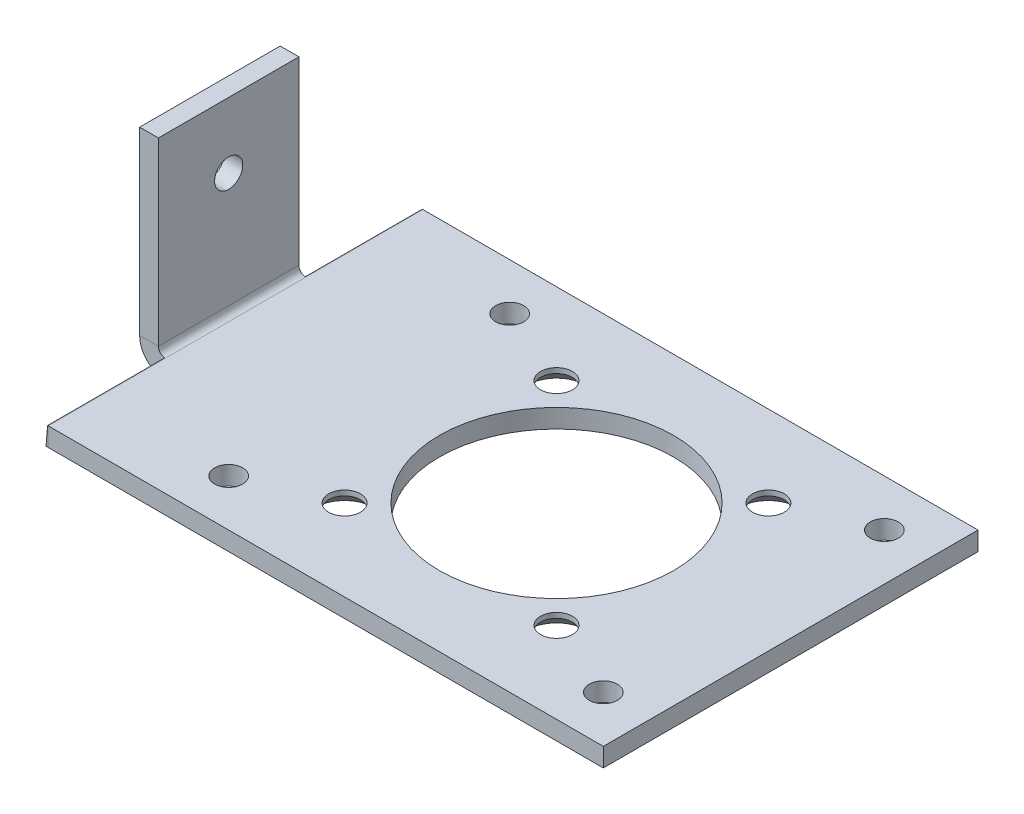
ISO-10303-21;
HEADER;
FILE_DESCRIPTION(('STEP AP214'),'2;1');
FILE_NAME('part.step','',(''),(''),'','','');
FILE_SCHEMA(('AUTOMOTIVE_DESIGN { 1 0 10303 214 1 1 1 1 }'));
ENDSEC;
DATA;
#1=APPLICATION_CONTEXT('core data for automotive mechanical design processes');
#2=APPLICATION_PROTOCOL_DEFINITION('international standard','automotive_design',2000,#1);
#3=PRODUCT_CONTEXT('',#1,'mechanical');
#4=PRODUCT('Part','Part','',(#3));
#5=PRODUCT_RELATED_PRODUCT_CATEGORY('part','',(#4));
#6=PRODUCT_DEFINITION_FORMATION('','',#4);
#7=PRODUCT_DEFINITION_CONTEXT('part definition',#1,'design');
#8=PRODUCT_DEFINITION('design','',#6,#7);
#9=PRODUCT_DEFINITION_SHAPE('','',#8);
#10=(LENGTH_UNIT() NAMED_UNIT(*) SI_UNIT(.MILLI.,.METRE.));
#11=(NAMED_UNIT(*) PLANE_ANGLE_UNIT() SI_UNIT($,.RADIAN.));
#12=(NAMED_UNIT(*) SI_UNIT($,.STERADIAN.) SOLID_ANGLE_UNIT());
#13=UNCERTAINTY_MEASURE_WITH_UNIT(LENGTH_MEASURE(1.E-05),#10,'distance_accuracy_value','');
#14=(GEOMETRIC_REPRESENTATION_CONTEXT(3) GLOBAL_UNCERTAINTY_ASSIGNED_CONTEXT((#13)) GLOBAL_UNIT_ASSIGNED_CONTEXT((#10,
#11,#12)) REPRESENTATION_CONTEXT('',''));
#15=CARTESIAN_POINT('',(0.,0.,0.));
#16=DIRECTION('',(0.,0.,1.));
#17=DIRECTION('',(1.,0.,0.));
#18=AXIS2_PLACEMENT_3D('',#15,#16,#17);
#19=CARTESIAN_POINT('',(0.7366,0.7366,40.));
#20=DIRECTION('',(0.,0.,-1.));
#21=DIRECTION('',(-1.,0.,0.));
#22=AXIS2_PLACEMENT_3D('',#19,#20,#21);
#23=CYLINDRICAL_SURFACE('',#22,0.7366);
#24=DIRECTION('',(0.,0.,-1.));
#25=VECTOR('',#24,1.);
#26=CARTESIAN_POINT('',(0.672915296353139,0.0027581788141183,40.));
#27=LINE('',#26,#25);
#28=CARTESIAN_POINT('',(0.672915296353139,0.0027581788141183,0.));
#29=VERTEX_POINT('',#28);
#30=CARTESIAN_POINT('',(0.672915296353139,0.0027581788141183,12.5));
#31=VERTEX_POINT('',#30);
#32=EDGE_CURVE('E65',#29,#31,#27,.F.);
#33=ORIENTED_EDGE('',*,*,#32,.T.);
#34=CARTESIAN_POINT('',(0.7366,0.7366,12.5));
#35=DIRECTION('',(0.,0.,1.));
#36=DIRECTION('',(0.,-1.,0.));
#37=AXIS2_PLACEMENT_3D('',#34,#35,#36);
#38=CIRCLE('',#37,0.7366);
#39=CARTESIAN_POINT('',(0.,0.7366,12.5));
#40=VERTEX_POINT('',#39);
#41=EDGE_CURVE('E141',#40,#31,#38,.T.);
#42=ORIENTED_EDGE('',*,*,#41,.F.);
#43=DIRECTION('',(0.,0.,-1.));
#44=VECTOR('',#43,1.);
#45=CARTESIAN_POINT('',(0.,0.7366,40.));
#46=LINE('',#45,#44);
#47=CARTESIAN_POINT('',(0.,0.7366,27.5));
#48=VERTEX_POINT('',#47);
#49=EDGE_CURVE('E293',#48,#40,#46,.T.);
#50=ORIENTED_EDGE('',*,*,#49,.F.);
#51=CARTESIAN_POINT('',(0.7366,0.7366,27.5));
#52=DIRECTION('',(0.,0.,-1.));
#53=DIRECTION('',(0.,1.,0.));
#54=AXIS2_PLACEMENT_3D('',#51,#52,#53);
#55=CIRCLE('',#54,0.7366);
#56=CARTESIAN_POINT('',(0.672915296353139,0.0027581788141183,27.5));
#57=VERTEX_POINT('',#56);
#58=EDGE_CURVE('E181',#57,#48,#55,.T.);
#59=ORIENTED_EDGE('',*,*,#58,.F.);
#60=DIRECTION('',(0.,0.,-1.));
#61=VECTOR('',#60,1.);
#62=CARTESIAN_POINT('',(0.672915296353139,0.0027581788141183,40.));
#63=LINE('',#62,#61);
#64=CARTESIAN_POINT('',(0.672915296353139,0.0027581788141183,40.));
#65=VERTEX_POINT('',#64);
#66=EDGE_CURVE('E175',#65,#57,#63,.T.);
#67=ORIENTED_EDGE('',*,*,#66,.F.);
#68=CARTESIAN_POINT('',(0.7366,0.7366,40.));
#69=DIRECTION('',(0.,0.,-1.));
#70=DIRECTION('',(-1.,0.,0.));
#71=AXIS2_PLACEMENT_3D('',#68,#69,#70);
#72=CIRCLE('',#71,0.7366);
#73=CARTESIAN_POINT('',(0.7366,0.,40.));
#74=VERTEX_POINT('',#73);
#75=EDGE_CURVE('E267',#65,#74,#72,.F.);
#76=ORIENTED_EDGE('',*,*,#75,.T.);
#77=DIRECTION('',(0.,0.,-1.));
#78=VECTOR('',#77,1.);
#79=CARTESIAN_POINT('',(0.7366,0.,40.));
#80=LINE('',#79,#78);
#81=CARTESIAN_POINT('',(0.7366,0.,0.));
#82=VERTEX_POINT('',#81);
#83=EDGE_CURVE('E295',#74,#82,#80,.T.);
#84=ORIENTED_EDGE('',*,*,#83,.T.);
#85=CARTESIAN_POINT('',(0.7366,0.7366,0.));
#86=DIRECTION('',(0.,0.,-1.));
#87=DIRECTION('',(-1.,0.,0.));
#88=AXIS2_PLACEMENT_3D('',#85,#86,#87);
#89=CIRCLE('',#88,0.7366);
#90=EDGE_CURVE('E159',#29,#82,#89,.F.);
#91=ORIENTED_EDGE('',*,*,#90,.F.);
#92=EDGE_LOOP('',(#33,#42,#50,#59,#67,#76,#84,#91));
#93=FACE_BOUND('',#92,.T.);
#94=ADVANCED_FACE('F48',(#93),#23,.F.);
#95=CARTESIAN_POINT('',(0.,0.,40.));
#96=DIRECTION('',(1.,0.,0.));
#97=DIRECTION('',(0.,0.,-1.));
#98=AXIS2_PLACEMENT_3D('',#95,#96,#97);
#99=PLANE('',#98);
#100=CARTESIAN_POINT('',(0.,13.,20.));
#101=DIRECTION('',(1.,0.,0.));
#102=DIRECTION('',(0.,0.,-1.));
#103=AXIS2_PLACEMENT_3D('',#100,#101,#102);
#104=CIRCLE('',#103,1.49999999999999);
#105=CARTESIAN_POINT('',(0.,13.,18.5));
#106=VERTEX_POINT('',#105);
#107=EDGE_CURVE('E248',#106,#106,#104,.T.);
#108=ORIENTED_EDGE('',*,*,#107,.F.);
#109=EDGE_LOOP('',(#108));
#110=FACE_BOUND('',#109,.T.);
#111=ORIENTED_EDGE('',*,*,#49,.T.);
#112=DIRECTION('',(0.,-1.,0.));
#113=VECTOR('',#112,1.);
#114=CARTESIAN_POINT('',(0.,0.,12.5));
#115=LINE('',#114,#113);
#116=CARTESIAN_POINT('',(0.,20.,12.5));
#117=VERTEX_POINT('',#116);
#118=EDGE_CURVE('E164',#117,#40,#115,.T.);
#119=ORIENTED_EDGE('',*,*,#118,.F.);
#120=DIRECTION('',(0.,0.,-1.));
#121=VECTOR('',#120,1.);
#122=CARTESIAN_POINT('',(0.,20.,40.));
#123=LINE('',#122,#121);
#124=CARTESIAN_POINT('',(0.,20.,27.5));
#125=VERTEX_POINT('',#124);
#126=EDGE_CURVE('E290',#125,#117,#123,.T.);
#127=ORIENTED_EDGE('',*,*,#126,.F.);
#128=DIRECTION('',(0.,1.,0.));
#129=VECTOR('',#128,1.);
#130=CARTESIAN_POINT('',(0.,0.,27.5));
#131=LINE('',#130,#129);
#132=EDGE_CURVE('E188',#125,#48,#131,.F.);
#133=ORIENTED_EDGE('',*,*,#132,.T.);
#134=EDGE_LOOP('',(#111,#119,#127,#133));
#135=FACE_BOUND('',#134,.T.);
#136=ADVANCED_FACE('F372',(#110,#135),#99,.T.);
#137=CARTESIAN_POINT('',(-2.,20.,40.));
#138=DIRECTION('',(0.,1.,0.));
#139=DIRECTION('',(0.,0.,1.));
#140=AXIS2_PLACEMENT_3D('',#137,#138,#139);
#141=PLANE('',#140);
#142=ORIENTED_EDGE('',*,*,#126,.T.);
#143=DIRECTION('',(1.,0.,0.));
#144=VECTOR('',#143,1.);
#145=CARTESIAN_POINT('',(0.,20.,12.5));
#146=LINE('',#145,#144);
#147=CARTESIAN_POINT('',(-2.,20.,12.5));
#148=VERTEX_POINT('',#147);
#149=EDGE_CURVE('E169',#117,#148,#146,.F.);
#150=ORIENTED_EDGE('',*,*,#149,.T.);
#151=DIRECTION('',(0.,0.,-1.));
#152=VECTOR('',#151,1.);
#153=CARTESIAN_POINT('',(-2.,20.,40.));
#154=LINE('',#153,#152);
#155=CARTESIAN_POINT('',(-2.,20.,27.5));
#156=VERTEX_POINT('',#155);
#157=EDGE_CURVE('E287',#156,#148,#154,.T.);
#158=ORIENTED_EDGE('',*,*,#157,.F.);
#159=DIRECTION('',(-1.,0.,0.));
#160=VECTOR('',#159,1.);
#161=CARTESIAN_POINT('',(-2.,20.,27.5));
#162=LINE('',#161,#160);
#163=EDGE_CURVE('E193',#156,#125,#162,.F.);
#164=ORIENTED_EDGE('',*,*,#163,.T.);
#165=EDGE_LOOP('',(#142,#150,#158,#164));
#166=FACE_BOUND('',#165,.T.);
#167=ADVANCED_FACE('F377',(#166),#141,.T.);
#168=CARTESIAN_POINT('',(-2.,0.,40.));
#169=DIRECTION('',(1.,0.,0.));
#170=DIRECTION('',(0.,0.,-1.));
#171=AXIS2_PLACEMENT_3D('',#168,#169,#170);
#172=PLANE('',#171);
#173=CARTESIAN_POINT('',(-2.,13.,20.));
#174=DIRECTION('',(-1.,0.,0.));
#175=DIRECTION('',(0.,0.,1.));
#176=AXIS2_PLACEMENT_3D('',#173,#174,#175);
#177=CIRCLE('',#176,1.5);
#178=CARTESIAN_POINT('',(-2.,13.,21.5));
#179=VERTEX_POINT('',#178);
#180=EDGE_CURVE('E245',#179,#179,#177,.T.);
#181=ORIENTED_EDGE('',*,*,#180,.F.);
#182=EDGE_LOOP('',(#181));
#183=FACE_BOUND('',#182,.T.);
#184=DIRECTION('',(0.,1.,0.));
#185=VECTOR('',#184,1.);
#186=CARTESIAN_POINT('',(-2.,0.,12.5));
#187=LINE('',#186,#185);
#188=CARTESIAN_POINT('',(-2.,0.7366,12.5));
#189=VERTEX_POINT('',#188);
#190=EDGE_CURVE('E166',#148,#189,#187,.F.);
#191=ORIENTED_EDGE('',*,*,#190,.T.);
#192=DIRECTION('',(0.,0.,-1.));
#193=VECTOR('',#192,1.);
#194=CARTESIAN_POINT('',(-2.,0.7366,40.));
#195=LINE('',#194,#193);
#196=CARTESIAN_POINT('',(-2.,0.7366,27.5));
#197=VERTEX_POINT('',#196);
#198=EDGE_CURVE('E284',#197,#189,#195,.T.);
#199=ORIENTED_EDGE('',*,*,#198,.F.);
#200=DIRECTION('',(0.,-1.,0.));
#201=VECTOR('',#200,1.);
#202=CARTESIAN_POINT('',(-2.,20.,27.5));
#203=LINE('',#202,#201);
#204=EDGE_CURVE('E186',#156,#197,#203,.T.);
#205=ORIENTED_EDGE('',*,*,#204,.F.);
#206=ORIENTED_EDGE('',*,*,#157,.T.);
#207=EDGE_LOOP('',(#191,#199,#205,#206));
#208=FACE_BOUND('',#207,.T.);
#209=ADVANCED_FACE('F383',(#183,#208),#172,.F.);
#210=CARTESIAN_POINT('',(0.7366,0.7366,40.));
#211=DIRECTION('',(0.,0.,-1.));
#212=DIRECTION('',(-1.,0.,0.));
#213=AXIS2_PLACEMENT_3D('',#210,#211,#212);
#214=CYLINDRICAL_SURFACE('',#213,2.7366);
#215=CARTESIAN_POINT('',(0.7366,0.7366,12.5));
#216=DIRECTION('',(0.,0.,-1.));
#217=DIRECTION('',(-1.,0.,0.));
#218=AXIS2_PLACEMENT_3D('',#215,#216,#217);
#219=CIRCLE('',#218,2.7366);
#220=CARTESIAN_POINT('',(0.5,-1.98975287517959,12.5));
#221=VERTEX_POINT('',#220);
#222=EDGE_CURVE('E150',#189,#221,#219,.F.);
#223=ORIENTED_EDGE('',*,*,#222,.T.);
#224=DIRECTION('',(0.,0.,-1.));
#225=VECTOR('',#224,1.);
#226=CARTESIAN_POINT('',(0.5,-1.98975287517959,40.));
#227=LINE('',#226,#225);
#228=CARTESIAN_POINT('',(0.5,-1.98975287517959,0.));
#229=VERTEX_POINT('',#228);
#230=EDGE_CURVE('E155',#229,#221,#227,.F.);
#231=ORIENTED_EDGE('',*,*,#230,.F.);
#232=CARTESIAN_POINT('',(0.7366,0.7366,0.));
#233=DIRECTION('',(0.,0.,1.));
#234=DIRECTION('',(1.,0.,0.));
#235=AXIS2_PLACEMENT_3D('',#232,#233,#234);
#236=CIRCLE('',#235,2.7366);
#237=CARTESIAN_POINT('',(0.7366,-2.,0.));
#238=VERTEX_POINT('',#237);
#239=EDGE_CURVE('E261',#229,#238,#236,.T.);
#240=ORIENTED_EDGE('',*,*,#239,.T.);
#241=DIRECTION('',(0.,0.,-1.));
#242=VECTOR('',#241,1.);
#243=CARTESIAN_POINT('',(0.7366,-2.,40.));
#244=LINE('',#243,#242);
#245=CARTESIAN_POINT('',(0.7366,-2.,40.));
#246=VERTEX_POINT('',#245);
#247=EDGE_CURVE('E271',#246,#238,#244,.T.);
#248=ORIENTED_EDGE('',*,*,#247,.F.);
#249=CARTESIAN_POINT('',(0.7366,0.7366,40.));
#250=DIRECTION('',(0.,0.,1.));
#251=DIRECTION('',(1.,0.,0.));
#252=AXIS2_PLACEMENT_3D('',#249,#250,#251);
#253=CIRCLE('',#252,2.7366);
#254=CARTESIAN_POINT('',(0.5,-1.98975287517959,40.));
#255=VERTEX_POINT('',#254);
#256=EDGE_CURVE('E269',#255,#246,#253,.T.);
#257=ORIENTED_EDGE('',*,*,#256,.F.);
#258=DIRECTION('',(0.,0.,-1.));
#259=VECTOR('',#258,1.);
#260=CARTESIAN_POINT('',(0.5,-1.98975287517959,40.));
#261=LINE('',#260,#259);
#262=CARTESIAN_POINT('',(0.5,-1.98975287517959,27.5));
#263=VERTEX_POINT('',#262);
#264=EDGE_CURVE('E172',#255,#263,#261,.T.);
#265=ORIENTED_EDGE('',*,*,#264,.T.);
#266=CARTESIAN_POINT('',(0.7366,0.7366,27.5));
#267=DIRECTION('',(0.,0.,-1.));
#268=DIRECTION('',(-1.,0.,0.));
#269=AXIS2_PLACEMENT_3D('',#266,#267,#268);
#270=CIRCLE('',#269,2.7366);
#271=EDGE_CURVE('E183',#263,#197,#270,.T.);
#272=ORIENTED_EDGE('',*,*,#271,.T.);
#273=ORIENTED_EDGE('',*,*,#198,.T.);
#274=EDGE_LOOP('',(#223,#231,#240,#248,#257,#265,#272,#273));
#275=FACE_BOUND('',#274,.T.);
#276=ADVANCED_FACE('F360',(#275),#214,.T.);
#277=CARTESIAN_POINT('',(0.,0.7366,0.));
#278=DIRECTION('',(0.,0.,-1.));
#279=DIRECTION('',(-1.,0.,0.));
#280=AXIS2_PLACEMENT_3D('',#277,#278,#279);
#281=PLANE('',#280);
#282=ORIENTED_EDGE('',*,*,#239,.F.);
#283=DIRECTION('',(-0.0864576481765695,-0.996255526996852,0.));
#284=VECTOR('',#283,1.);
#285=CARTESIAN_POINT('',(0.5,-1.98975287517959,0.));
#286=LINE('',#285,#284);
#287=EDGE_CURVE('E151',#229,#29,#286,.F.);
#288=ORIENTED_EDGE('',*,*,#287,.T.);
#289=ORIENTED_EDGE('',*,*,#90,.T.);
#290=DIRECTION('',(0.,1.,0.));
#291=VECTOR('',#290,1.);
#292=CARTESIAN_POINT('',(0.7366,-2.,0.));
#293=LINE('',#292,#291);
#294=EDGE_CURVE('E57',#238,#82,#293,.T.);
#295=ORIENTED_EDGE('',*,*,#294,.F.);
#296=EDGE_LOOP('',(#282,#288,#289,#295));
#297=FACE_BOUND('',#296,.T.);
#298=ADVANCED_FACE('F390',(#297),#281,.T.);
#299=CARTESIAN_POINT('',(0.7366,0.,40.));
#300=DIRECTION('',(0.,0.,1.));
#301=DIRECTION('',(1.,0.,0.));
#302=AXIS2_PLACEMENT_3D('',#299,#300,#301);
#303=PLANE('',#302);
#304=ORIENTED_EDGE('',*,*,#75,.F.);
#305=DIRECTION('',(-0.0864576481765695,-0.996255526996852,0.));
#306=VECTOR('',#305,1.);
#307=CARTESIAN_POINT('',(0.5,-1.98975287517959,40.));
#308=LINE('',#307,#306);
#309=EDGE_CURVE('E179',#255,#65,#308,.F.);
#310=ORIENTED_EDGE('',*,*,#309,.F.);
#311=ORIENTED_EDGE('',*,*,#256,.T.);
#312=DIRECTION('',(0.,-1.,0.));
#313=VECTOR('',#312,1.);
#314=CARTESIAN_POINT('',(0.7366,0.,40.));
#315=LINE('',#314,#313);
#316=EDGE_CURVE('E13',#74,#246,#315,.T.);
#317=ORIENTED_EDGE('',*,*,#316,.F.);
#318=EDGE_LOOP('',(#304,#310,#311,#317));
#319=FACE_BOUND('',#318,.T.);
#320=ADVANCED_FACE('F50',(#319),#303,.T.);
#321=CARTESIAN_POINT('',(-2.,0.7366,40.));
#322=DIRECTION('',(0.,0.,1.));
#323=DIRECTION('',(1.,0.,0.));
#324=AXIS2_PLACEMENT_3D('',#321,#322,#323);
#325=PLANE('',#324);
#326=DIRECTION('',(1.,0.,0.));
#327=VECTOR('',#326,1.);
#328=CARTESIAN_POINT('',(0.,0.,40.));
#329=LINE('',#328,#327);
#330=CARTESIAN_POINT('',(60.,0.,40.));
#331=VERTEX_POINT('',#330);
#332=EDGE_CURVE('E264',#74,#331,#329,.T.);
#333=ORIENTED_EDGE('',*,*,#332,.F.);
#334=ORIENTED_EDGE('',*,*,#316,.T.);
#335=DIRECTION('',(1.,0.,0.));
#336=VECTOR('',#335,1.);
#337=CARTESIAN_POINT('',(0.,-2.,40.));
#338=LINE('',#337,#336);
#339=CARTESIAN_POINT('',(60.,-2.,40.));
#340=VERTEX_POINT('',#339);
#341=EDGE_CURVE('E258',#246,#340,#338,.T.);
#342=ORIENTED_EDGE('',*,*,#341,.T.);
#343=DIRECTION('',(0.,-1.,0.));
#344=VECTOR('',#343,1.);
#345=CARTESIAN_POINT('',(60.,0.,40.));
#346=LINE('',#345,#344);
#347=EDGE_CURVE('E260',#331,#340,#346,.T.);
#348=ORIENTED_EDGE('',*,*,#347,.F.);
#349=EDGE_LOOP('',(#333,#334,#342,#348));
#350=FACE_BOUND('',#349,.T.);
#351=ADVANCED_FACE('F355',(#350),#325,.T.);
#352=CARTESIAN_POINT('',(0.,-2.,40.));
#353=DIRECTION('',(0.,1.,0.));
#354=DIRECTION('',(0.,0.,1.));
#355=AXIS2_PLACEMENT_3D('',#352,#353,#354);
#356=PLANE('',#355);
#357=CARTESIAN_POINT('',(46.3137084989847,-2.,8.68629150101517));
#358=DIRECTION('',(0.,-1.,0.));
#359=DIRECTION('',(0.,0.,-1.));
#360=AXIS2_PLACEMENT_3D('',#357,#358,#359);
#361=CIRCLE('',#360,3.15);
#362=CARTESIAN_POINT('',(46.3137084989847,-2.,5.53629150101517));
#363=VERTEX_POINT('',#362);
#364=EDGE_CURVE('E196',#363,#363,#361,.T.);
#365=ORIENTED_EDGE('',*,*,#364,.F.);
#366=EDGE_LOOP('',(#365));
#367=FACE_BOUND('',#366,.T.);
#368=CARTESIAN_POINT('',(46.3137084989847,-2.,31.3137084989848));
#369=DIRECTION('',(0.,-1.,0.));
#370=DIRECTION('',(0.,0.,-1.));
#371=AXIS2_PLACEMENT_3D('',#368,#369,#370);
#372=CIRCLE('',#371,3.15);
#373=CARTESIAN_POINT('',(46.3137084989847,-2.,28.1637084989848));
#374=VERTEX_POINT('',#373);
#375=EDGE_CURVE('E204',#374,#374,#372,.T.);
#376=ORIENTED_EDGE('',*,*,#375,.F.);
#377=EDGE_LOOP('',(#376));
#378=FACE_BOUND('',#377,.T.);
#379=CARTESIAN_POINT('',(23.6862915010153,-2.,31.3137084989848));
#380=DIRECTION('',(0.,-1.,0.));
#381=DIRECTION('',(0.,0.,-1.));
#382=AXIS2_PLACEMENT_3D('',#379,#380,#381);
#383=CIRCLE('',#382,3.15);
#384=CARTESIAN_POINT('',(23.6862915010153,-2.,28.1637084989848));
#385=VERTEX_POINT('',#384);
#386=EDGE_CURVE('E211',#385,#385,#383,.T.);
#387=ORIENTED_EDGE('',*,*,#386,.F.);
#388=EDGE_LOOP('',(#387));
#389=FACE_BOUND('',#388,.T.);
#390=CARTESIAN_POINT('',(23.6862915010153,-2.,8.68629150101518));
#391=DIRECTION('',(0.,-1.,0.));
#392=DIRECTION('',(0.,0.,-1.));
#393=AXIS2_PLACEMENT_3D('',#390,#391,#392);
#394=CIRCLE('',#393,3.15);
#395=CARTESIAN_POINT('',(23.6862915010153,-2.,5.53629150101518));
#396=VERTEX_POINT('',#395);
#397=EDGE_CURVE('E218',#396,#396,#394,.T.);
#398=ORIENTED_EDGE('',*,*,#397,.F.);
#399=EDGE_LOOP('',(#398));
#400=FACE_BOUND('',#399,.T.);
#401=CARTESIAN_POINT('',(15.,-2.,5.));
#402=DIRECTION('',(0.,-1.,0.));
#403=DIRECTION('',(0.,0.,-1.));
#404=AXIS2_PLACEMENT_3D('',#401,#402,#403);
#405=CIRCLE('',#404,1.49999999999999);
#406=CARTESIAN_POINT('',(15.,-2.,3.50000000000001));
#407=VERTEX_POINT('',#406);
#408=EDGE_CURVE('E225',#407,#407,#405,.T.);
#409=ORIENTED_EDGE('',*,*,#408,.F.);
#410=EDGE_LOOP('',(#409));
#411=FACE_BOUND('',#410,.T.);
#412=CARTESIAN_POINT('',(55.,-2.,5.));
#413=DIRECTION('',(0.,-1.,0.));
#414=DIRECTION('',(0.,0.,-1.));
#415=AXIS2_PLACEMENT_3D('',#412,#413,#414);
#416=CIRCLE('',#415,1.49999999999999);
#417=CARTESIAN_POINT('',(55.,-2.,3.50000000000001));
#418=VERTEX_POINT('',#417);
#419=EDGE_CURVE('E231',#418,#418,#416,.T.);
#420=ORIENTED_EDGE('',*,*,#419,.F.);
#421=EDGE_LOOP('',(#420));
#422=FACE_BOUND('',#421,.T.);
#423=CARTESIAN_POINT('',(55.,-2.,34.9999999999996));
#424=DIRECTION('',(0.,-1.,0.));
#425=DIRECTION('',(0.,0.,-1.));
#426=AXIS2_PLACEMENT_3D('',#423,#424,#425);
#427=CIRCLE('',#426,1.49999999999999);
#428=CARTESIAN_POINT('',(55.,-2.,33.4999999999996));
#429=VERTEX_POINT('',#428);
#430=EDGE_CURVE('E235',#429,#429,#427,.T.);
#431=ORIENTED_EDGE('',*,*,#430,.F.);
#432=EDGE_LOOP('',(#431));
#433=FACE_BOUND('',#432,.T.);
#434=CARTESIAN_POINT('',(15.,-2.,35.));
#435=DIRECTION('',(0.,-1.,0.));
#436=DIRECTION('',(0.,0.,-1.));
#437=AXIS2_PLACEMENT_3D('',#434,#435,#436);
#438=CIRCLE('',#437,1.49999999999999);
#439=CARTESIAN_POINT('',(15.,-2.,33.5));
#440=VERTEX_POINT('',#439);
#441=EDGE_CURVE('E239',#440,#440,#438,.T.);
#442=ORIENTED_EDGE('',*,*,#441,.F.);
#443=EDGE_LOOP('',(#442));
#444=FACE_BOUND('',#443,.T.);
#445=CARTESIAN_POINT('',(35.,-2.,20.));
#446=DIRECTION('',(0.,-1.,0.));
#447=DIRECTION('',(0.,0.,-1.));
#448=AXIS2_PLACEMENT_3D('',#445,#446,#447);
#449=CIRCLE('',#448,12.5);
#450=CARTESIAN_POINT('',(35.,-2.,7.5));
#451=VERTEX_POINT('',#450);
#452=EDGE_CURVE('E252',#451,#451,#449,.T.);
#453=ORIENTED_EDGE('',*,*,#452,.F.);
#454=EDGE_LOOP('',(#453));
#455=FACE_BOUND('',#454,.T.);
#456=DIRECTION('',(1.,0.,0.));
#457=VECTOR('',#456,1.);
#458=CARTESIAN_POINT('',(0.,-2.,0.));
#459=LINE('',#458,#457);
#460=CARTESIAN_POINT('',(60.,-2.,0.));
#461=VERTEX_POINT('',#460);
#462=EDGE_CURVE('E255',#238,#461,#459,.T.);
#463=ORIENTED_EDGE('',*,*,#462,.T.);
#464=DIRECTION('',(0.,0.,-1.));
#465=VECTOR('',#464,1.);
#466=CARTESIAN_POINT('',(60.,-2.,40.));
#467=LINE('',#466,#465);
#468=EDGE_CURVE('E299',#340,#461,#467,.T.);
#469=ORIENTED_EDGE('',*,*,#468,.F.);
#470=ORIENTED_EDGE('',*,*,#341,.F.);
#471=ORIENTED_EDGE('',*,*,#247,.T.);
#472=EDGE_LOOP('',(#463,#469,#470,#471));
#473=FACE_BOUND('',#472,.T.);
#474=ADVANCED_FACE('F362',(#367,#378,#389,#400,#411,#422,#433,#444,#455,#473),#356,.F.);
#475=CARTESIAN_POINT('',(60.,0.,40.));
#476=DIRECTION('',(1.,0.,0.));
#477=DIRECTION('',(0.,0.,-1.));
#478=AXIS2_PLACEMENT_3D('',#475,#476,#477);
#479=PLANE('',#478);
#480=DIRECTION('',(0.,-1.,0.));
#481=VECTOR('',#480,1.);
#482=CARTESIAN_POINT('',(60.,0.,0.));
#483=LINE('',#482,#481);
#484=CARTESIAN_POINT('',(60.,0.,0.));
#485=VERTEX_POINT('',#484);
#486=EDGE_CURVE('E274',#485,#461,#483,.T.);
#487=ORIENTED_EDGE('',*,*,#486,.F.);
#488=DIRECTION('',(0.,0.,-1.));
#489=VECTOR('',#488,1.);
#490=CARTESIAN_POINT('',(60.,0.,40.));
#491=LINE('',#490,#489);
#492=EDGE_CURVE('E297',#331,#485,#491,.T.);
#493=ORIENTED_EDGE('',*,*,#492,.F.);
#494=ORIENTED_EDGE('',*,*,#347,.T.);
#495=ORIENTED_EDGE('',*,*,#468,.T.);
#496=EDGE_LOOP('',(#487,#493,#494,#495));
#497=FACE_BOUND('',#496,.T.);
#498=ADVANCED_FACE('F320',(#497),#479,.T.);
#499=CARTESIAN_POINT('',(0.,0.,40.));
#500=DIRECTION('',(0.,1.,0.));
#501=DIRECTION('',(0.,0.,1.));
#502=AXIS2_PLACEMENT_3D('',#499,#500,#501);
#503=PLANE('',#502);
#504=CARTESIAN_POINT('',(46.3137084989847,0.,8.68629150101517));
#505=DIRECTION('',(0.,1.,0.));
#506=DIRECTION('',(0.,0.,1.));
#507=AXIS2_PLACEMENT_3D('',#504,#505,#506);
#508=CIRCLE('',#507,1.7);
#509=CARTESIAN_POINT('',(46.3137084989847,0.,10.3862915010152));
#510=VERTEX_POINT('',#509);
#511=EDGE_CURVE('E52',#510,#510,#508,.T.);
#512=ORIENTED_EDGE('',*,*,#511,.F.);
#513=EDGE_LOOP('',(#512));
#514=FACE_BOUND('',#513,.T.);
#515=CARTESIAN_POINT('',(46.3137084989847,0.,31.3137084989848));
#516=DIRECTION('',(0.,1.,0.));
#517=DIRECTION('',(0.,0.,1.));
#518=AXIS2_PLACEMENT_3D('',#515,#516,#517);
#519=CIRCLE('',#518,1.7);
#520=CARTESIAN_POINT('',(46.3137084989847,0.,33.0137084989848));
#521=VERTEX_POINT('',#520);
#522=EDGE_CURVE('E210',#521,#521,#519,.T.);
#523=ORIENTED_EDGE('',*,*,#522,.F.);
#524=EDGE_LOOP('',(#523));
#525=FACE_BOUND('',#524,.T.);
#526=CARTESIAN_POINT('',(23.6862915010153,0.,31.3137084989848));
#527=DIRECTION('',(0.,1.,0.));
#528=DIRECTION('',(0.,0.,1.));
#529=AXIS2_PLACEMENT_3D('',#526,#527,#528);
#530=CIRCLE('',#529,1.7);
#531=CARTESIAN_POINT('',(23.6862915010153,0.,33.0137084989848));
#532=VERTEX_POINT('',#531);
#533=EDGE_CURVE('E217',#532,#532,#530,.T.);
#534=ORIENTED_EDGE('',*,*,#533,.F.);
#535=EDGE_LOOP('',(#534));
#536=FACE_BOUND('',#535,.T.);
#537=CARTESIAN_POINT('',(23.6862915010153,0.,8.68629150101518));
#538=DIRECTION('',(0.,1.,0.));
#539=DIRECTION('',(0.,0.,1.));
#540=AXIS2_PLACEMENT_3D('',#537,#538,#539);
#541=CIRCLE('',#540,1.7);
#542=CARTESIAN_POINT('',(23.6862915010153,0.,10.3862915010152));
#543=VERTEX_POINT('',#542);
#544=EDGE_CURVE('E224',#543,#543,#541,.T.);
#545=ORIENTED_EDGE('',*,*,#544,.F.);
#546=EDGE_LOOP('',(#545));
#547=FACE_BOUND('',#546,.T.);
#548=CARTESIAN_POINT('',(15.,0.,5.));
#549=DIRECTION('',(0.,1.,0.));
#550=DIRECTION('',(0.,0.,1.));
#551=AXIS2_PLACEMENT_3D('',#548,#549,#550);
#552=CIRCLE('',#551,1.49999999999999);
#553=CARTESIAN_POINT('',(15.,0.,6.49999999999999));
#554=VERTEX_POINT('',#553);
#555=EDGE_CURVE('E228',#554,#554,#552,.T.);
#556=ORIENTED_EDGE('',*,*,#555,.F.);
#557=EDGE_LOOP('',(#556));
#558=FACE_BOUND('',#557,.T.);
#559=CARTESIAN_POINT('',(55.,0.,5.));
#560=DIRECTION('',(0.,1.,0.));
#561=DIRECTION('',(0.,0.,1.));
#562=AXIS2_PLACEMENT_3D('',#559,#560,#561);
#563=CIRCLE('',#562,1.49999999999999);
#564=CARTESIAN_POINT('',(55.,0.,6.49999999999999));
#565=VERTEX_POINT('',#564);
#566=EDGE_CURVE('E234',#565,#565,#563,.T.);
#567=ORIENTED_EDGE('',*,*,#566,.F.);
#568=EDGE_LOOP('',(#567));
#569=FACE_BOUND('',#568,.T.);
#570=CARTESIAN_POINT('',(55.,0.,34.9999999999996));
#571=DIRECTION('',(0.,1.,0.));
#572=DIRECTION('',(0.,0.,1.));
#573=AXIS2_PLACEMENT_3D('',#570,#571,#572);
#574=CIRCLE('',#573,1.49999999999999);
#575=CARTESIAN_POINT('',(55.,0.,36.4999999999996));
#576=VERTEX_POINT('',#575);
#577=EDGE_CURVE('E238',#576,#576,#574,.T.);
#578=ORIENTED_EDGE('',*,*,#577,.F.);
#579=EDGE_LOOP('',(#578));
#580=FACE_BOUND('',#579,.T.);
#581=CARTESIAN_POINT('',(15.,0.,35.));
#582=DIRECTION('',(0.,1.,0.));
#583=DIRECTION('',(0.,0.,1.));
#584=AXIS2_PLACEMENT_3D('',#581,#582,#583);
#585=CIRCLE('',#584,1.49999999999999);
#586=CARTESIAN_POINT('',(15.,0.,36.5));
#587=VERTEX_POINT('',#586);
#588=EDGE_CURVE('E242',#587,#587,#585,.T.);
#589=ORIENTED_EDGE('',*,*,#588,.F.);
#590=EDGE_LOOP('',(#589));
#591=FACE_BOUND('',#590,.T.);
#592=CARTESIAN_POINT('',(35.,0.,20.));
#593=DIRECTION('',(0.,1.,0.));
#594=DIRECTION('',(0.,0.,1.));
#595=AXIS2_PLACEMENT_3D('',#592,#593,#594);
#596=CIRCLE('',#595,12.5);
#597=CARTESIAN_POINT('',(35.,0.,32.5));
#598=VERTEX_POINT('',#597);
#599=EDGE_CURVE('E251',#598,#598,#596,.F.);
#600=ORIENTED_EDGE('',*,*,#599,.T.);
#601=EDGE_LOOP('',(#600));
#602=FACE_BOUND('',#601,.T.);
#603=DIRECTION('',(1.,0.,0.));
#604=VECTOR('',#603,1.);
#605=CARTESIAN_POINT('',(0.,0.,0.));
#606=LINE('',#605,#604);
#607=EDGE_CURVE('E277',#82,#485,#606,.T.);
#608=ORIENTED_EDGE('',*,*,#607,.F.);
#609=ORIENTED_EDGE('',*,*,#83,.F.);
#610=ORIENTED_EDGE('',*,*,#332,.T.);
#611=ORIENTED_EDGE('',*,*,#492,.T.);
#612=EDGE_LOOP('',(#608,#609,#610,#611));
#613=FACE_BOUND('',#612,.T.);
#614=ADVANCED_FACE('F316',(#514,#525,#536,#547,#558,#569,#580,#591,#602,#613),#503,.T.);
#615=CARTESIAN_POINT('',(0.7366,0.7366,0.));
#616=DIRECTION('',(0.,0.,-1.));
#617=DIRECTION('',(-1.,0.,0.));
#618=AXIS2_PLACEMENT_3D('',#615,#616,#617);
#619=PLANE('',#618);
#620=ORIENTED_EDGE('',*,*,#462,.F.);
#621=ORIENTED_EDGE('',*,*,#294,.T.);
#622=ORIENTED_EDGE('',*,*,#607,.T.);
#623=ORIENTED_EDGE('',*,*,#486,.T.);
#624=EDGE_LOOP('',(#620,#621,#622,#623));
#625=FACE_BOUND('',#624,.T.);
#626=ADVANCED_FACE('F319',(#625),#619,.T.);
#627=CARTESIAN_POINT('',(35.,20.001,20.));
#628=DIRECTION('',(0.,-1.,0.));
#629=DIRECTION('',(0.,0.,-1.));
#630=AXIS2_PLACEMENT_3D('',#627,#628,#629);
#631=CYLINDRICAL_SURFACE('',#630,12.5);
#632=ORIENTED_EDGE('',*,*,#599,.F.);
#633=EDGE_LOOP('',(#632));
#634=FACE_BOUND('',#633,.T.);
#635=ORIENTED_EDGE('',*,*,#452,.T.);
#636=EDGE_LOOP('',(#635));
#637=FACE_BOUND('',#636,.T.);
#638=ADVANCED_FACE('F393',(#634,#637),#631,.F.);
#639=CARTESIAN_POINT('',(-2.,13.,20.));
#640=DIRECTION('',(-1.,0.,0.));
#641=DIRECTION('',(0.,0.,1.));
#642=AXIS2_PLACEMENT_3D('',#639,#640,#641);
#643=CYLINDRICAL_SURFACE('',#642,1.49999999999999);
#644=ORIENTED_EDGE('',*,*,#107,.T.);
#645=EDGE_LOOP('',(#644));
#646=FACE_BOUND('',#645,.T.);
#647=ORIENTED_EDGE('',*,*,#180,.T.);
#648=EDGE_LOOP('',(#647));
#649=FACE_BOUND('',#648,.T.);
#650=ADVANCED_FACE('F396',(#646,#649),#643,.F.);
#651=CARTESIAN_POINT('',(15.,-2.,35.));
#652=DIRECTION('',(0.,-1.,0.));
#653=DIRECTION('',(0.,0.,-1.));
#654=AXIS2_PLACEMENT_3D('',#651,#652,#653);
#655=CYLINDRICAL_SURFACE('',#654,1.49999999999999);
#656=ORIENTED_EDGE('',*,*,#588,.T.);
#657=EDGE_LOOP('',(#656));
#658=FACE_BOUND('',#657,.T.);
#659=ORIENTED_EDGE('',*,*,#441,.T.);
#660=EDGE_LOOP('',(#659));
#661=FACE_BOUND('',#660,.T.);
#662=ADVANCED_FACE('F400',(#658,#661),#655,.F.);
#663=CARTESIAN_POINT('',(55.,-2.,34.9999999999996));
#664=DIRECTION('',(0.,-1.,0.));
#665=DIRECTION('',(0.,0.,-1.));
#666=AXIS2_PLACEMENT_3D('',#663,#664,#665);
#667=CYLINDRICAL_SURFACE('',#666,1.49999999999999);
#668=ORIENTED_EDGE('',*,*,#577,.T.);
#669=EDGE_LOOP('',(#668));
#670=FACE_BOUND('',#669,.T.);
#671=ORIENTED_EDGE('',*,*,#430,.T.);
#672=EDGE_LOOP('',(#671));
#673=FACE_BOUND('',#672,.T.);
#674=ADVANCED_FACE('F404',(#670,#673),#667,.F.);
#675=CARTESIAN_POINT('',(55.,-2.,5.));
#676=DIRECTION('',(0.,-1.,0.));
#677=DIRECTION('',(0.,0.,-1.));
#678=AXIS2_PLACEMENT_3D('',#675,#676,#677);
#679=CYLINDRICAL_SURFACE('',#678,1.49999999999999);
#680=ORIENTED_EDGE('',*,*,#566,.T.);
#681=EDGE_LOOP('',(#680));
#682=FACE_BOUND('',#681,.T.);
#683=ORIENTED_EDGE('',*,*,#419,.T.);
#684=EDGE_LOOP('',(#683));
#685=FACE_BOUND('',#684,.T.);
#686=ADVANCED_FACE('F408',(#682,#685),#679,.F.);
#687=CARTESIAN_POINT('',(15.,-2.,5.));
#688=DIRECTION('',(0.,-1.,0.));
#689=DIRECTION('',(0.,0.,-1.));
#690=AXIS2_PLACEMENT_3D('',#687,#688,#689);
#691=CYLINDRICAL_SURFACE('',#690,1.49999999999999);
#692=ORIENTED_EDGE('',*,*,#555,.T.);
#693=EDGE_LOOP('',(#692));
#694=FACE_BOUND('',#693,.T.);
#695=ORIENTED_EDGE('',*,*,#408,.T.);
#696=EDGE_LOOP('',(#695));
#697=FACE_BOUND('',#696,.T.);
#698=ADVANCED_FACE('F412',(#694,#697),#691,.F.);
#699=CARTESIAN_POINT('',(23.6862915010153,-2.,8.68629150101518));
#700=DIRECTION('',(0.,-1.,0.));
#701=DIRECTION('',(0.,0.,-1.));
#702=AXIS2_PLACEMENT_3D('',#699,#700,#701);
#703=CYLINDRICAL_SURFACE('',#702,1.7);
#704=ORIENTED_EDGE('',*,*,#544,.T.);
#705=EDGE_LOOP('',(#704));
#706=FACE_BOUND('',#705,.T.);
#707=CARTESIAN_POINT('',(23.6862915010153,-0.549999999999998,8.68629150101518));
#708=DIRECTION('',(0.,-1.,0.));
#709=DIRECTION('',(0.,0.,-1.));
#710=AXIS2_PLACEMENT_3D('',#707,#708,#709);
#711=CIRCLE('',#710,1.7);
#712=CARTESIAN_POINT('',(23.6862915010153,-0.549999999999998,6.98629150101518));
#713=VERTEX_POINT('',#712);
#714=EDGE_CURVE('E221',#713,#713,#711,.T.);
#715=ORIENTED_EDGE('',*,*,#714,.T.);
#716=EDGE_LOOP('',(#715));
#717=FACE_BOUND('',#716,.T.);
#718=ADVANCED_FACE('F416',(#706,#717),#703,.F.);
#719=CARTESIAN_POINT('',(23.6862915010153,-2.,8.68629150101518));
#720=DIRECTION('',(0.,-1.,0.));
#721=DIRECTION('',(0.,0.,-1.));
#722=AXIS2_PLACEMENT_3D('',#719,#720,#721);
#723=CONICAL_SURFACE('',#722,3.15,0.785398163397447);
#724=ORIENTED_EDGE('',*,*,#714,.F.);
#725=EDGE_LOOP('',(#724));
#726=FACE_BOUND('',#725,.T.);
#727=ORIENTED_EDGE('',*,*,#397,.T.);
#728=EDGE_LOOP('',(#727));
#729=FACE_BOUND('',#728,.T.);
#730=ADVANCED_FACE('F420',(#726,#729),#723,.F.);
#731=CARTESIAN_POINT('',(23.6862915010153,-2.,31.3137084989848));
#732=DIRECTION('',(0.,-1.,0.));
#733=DIRECTION('',(0.,0.,-1.));
#734=AXIS2_PLACEMENT_3D('',#731,#732,#733);
#735=CYLINDRICAL_SURFACE('',#734,1.7);
#736=ORIENTED_EDGE('',*,*,#533,.T.);
#737=EDGE_LOOP('',(#736));
#738=FACE_BOUND('',#737,.T.);
#739=CARTESIAN_POINT('',(23.6862915010153,-0.549999999999998,31.3137084989848));
#740=DIRECTION('',(0.,-1.,0.));
#741=DIRECTION('',(0.,0.,-1.));
#742=AXIS2_PLACEMENT_3D('',#739,#740,#741);
#743=CIRCLE('',#742,1.7);
#744=CARTESIAN_POINT('',(23.6862915010153,-0.549999999999998,29.6137084989848));
#745=VERTEX_POINT('',#744);
#746=EDGE_CURVE('E214',#745,#745,#743,.T.);
#747=ORIENTED_EDGE('',*,*,#746,.T.);
#748=EDGE_LOOP('',(#747));
#749=FACE_BOUND('',#748,.T.);
#750=ADVANCED_FACE('F424',(#738,#749),#735,.F.);
#751=CARTESIAN_POINT('',(23.6862915010153,-2.,31.3137084989848));
#752=DIRECTION('',(0.,-1.,0.));
#753=DIRECTION('',(0.,0.,-1.));
#754=AXIS2_PLACEMENT_3D('',#751,#752,#753);
#755=CONICAL_SURFACE('',#754,3.15,0.785398163397447);
#756=ORIENTED_EDGE('',*,*,#746,.F.);
#757=EDGE_LOOP('',(#756));
#758=FACE_BOUND('',#757,.T.);
#759=ORIENTED_EDGE('',*,*,#386,.T.);
#760=EDGE_LOOP('',(#759));
#761=FACE_BOUND('',#760,.T.);
#762=ADVANCED_FACE('F428',(#758,#761),#755,.F.);
#763=CARTESIAN_POINT('',(46.3137084989847,-2.,31.3137084989848));
#764=DIRECTION('',(0.,-1.,0.));
#765=DIRECTION('',(0.,0.,-1.));
#766=AXIS2_PLACEMENT_3D('',#763,#764,#765);
#767=CYLINDRICAL_SURFACE('',#766,1.7);
#768=ORIENTED_EDGE('',*,*,#522,.T.);
#769=EDGE_LOOP('',(#768));
#770=FACE_BOUND('',#769,.T.);
#771=CARTESIAN_POINT('',(46.3137084989847,-0.549999999999998,31.3137084989848));
#772=DIRECTION('',(0.,-1.,0.));
#773=DIRECTION('',(0.,0.,-1.));
#774=AXIS2_PLACEMENT_3D('',#771,#772,#773);
#775=CIRCLE('',#774,1.7);
#776=CARTESIAN_POINT('',(46.3137084989847,-0.549999999999998,29.6137084989848));
#777=VERTEX_POINT('',#776);
#778=EDGE_CURVE('E207',#777,#777,#775,.T.);
#779=ORIENTED_EDGE('',*,*,#778,.T.);
#780=EDGE_LOOP('',(#779));
#781=FACE_BOUND('',#780,.T.);
#782=ADVANCED_FACE('F313',(#770,#781),#767,.F.);
#783=CARTESIAN_POINT('',(46.3137084989847,-2.,31.3137084989848));
#784=DIRECTION('',(0.,-1.,0.));
#785=DIRECTION('',(0.,0.,-1.));
#786=AXIS2_PLACEMENT_3D('',#783,#784,#785);
#787=CONICAL_SURFACE('',#786,3.15,0.785398163397447);
#788=ORIENTED_EDGE('',*,*,#778,.F.);
#789=EDGE_LOOP('',(#788));
#790=FACE_BOUND('',#789,.T.);
#791=ORIENTED_EDGE('',*,*,#375,.T.);
#792=EDGE_LOOP('',(#791));
#793=FACE_BOUND('',#792,.T.);
#794=ADVANCED_FACE('F435',(#790,#793),#787,.F.);
#795=CARTESIAN_POINT('',(46.3137084989847,-2.,8.68629150101517));
#796=DIRECTION('',(0.,-1.,0.));
#797=DIRECTION('',(0.,0.,-1.));
#798=AXIS2_PLACEMENT_3D('',#795,#796,#797);
#799=CYLINDRICAL_SURFACE('',#798,1.7);
#800=ORIENTED_EDGE('',*,*,#511,.T.);
#801=EDGE_LOOP('',(#800));
#802=FACE_BOUND('',#801,.T.);
#803=CARTESIAN_POINT('',(46.3137084989847,-0.549999999999998,8.68629150101517));
#804=DIRECTION('',(0.,-1.,0.));
#805=DIRECTION('',(0.,0.,-1.));
#806=AXIS2_PLACEMENT_3D('',#803,#804,#805);
#807=CIRCLE('',#806,1.7);
#808=CARTESIAN_POINT('',(46.3137084989847,-0.549999999999998,6.98629150101517));
#809=VERTEX_POINT('',#808);
#810=EDGE_CURVE('E201',#809,#809,#807,.T.);
#811=ORIENTED_EDGE('',*,*,#810,.T.);
#812=EDGE_LOOP('',(#811));
#813=FACE_BOUND('',#812,.T.);
#814=ADVANCED_FACE('F438',(#802,#813),#799,.F.);
#815=CARTESIAN_POINT('',(46.3137084989847,-2.,8.68629150101517));
#816=DIRECTION('',(0.,-1.,0.));
#817=DIRECTION('',(0.,0.,-1.));
#818=AXIS2_PLACEMENT_3D('',#815,#816,#817);
#819=CONICAL_SURFACE('',#818,3.15,0.785398163397447);
#820=ORIENTED_EDGE('',*,*,#810,.F.);
#821=EDGE_LOOP('',(#820));
#822=FACE_BOUND('',#821,.T.);
#823=ORIENTED_EDGE('',*,*,#364,.T.);
#824=EDGE_LOOP('',(#823));
#825=FACE_BOUND('',#824,.T.);
#826=ADVANCED_FACE('F442',(#822,#825),#819,.F.);
#827=CARTESIAN_POINT('',(-2.,20.,27.5));
#828=DIRECTION('',(0.,0.,1.));
#829=DIRECTION('',(0.,-1.,0.));
#830=AXIS2_PLACEMENT_3D('',#827,#828,#829);
#831=PLANE('',#830);
#832=ORIENTED_EDGE('',*,*,#163,.F.);
#833=ORIENTED_EDGE('',*,*,#204,.T.);
#834=DIRECTION('',(-1.,0.,0.));
#835=VECTOR('',#834,1.);
#836=CARTESIAN_POINT('',(-2.,0.7366,27.5));
#837=LINE('',#836,#835);
#838=EDGE_CURVE('E191',#197,#48,#837,.F.);
#839=ORIENTED_EDGE('',*,*,#838,.T.);
#840=ORIENTED_EDGE('',*,*,#132,.F.);
#841=EDGE_LOOP('',(#832,#833,#839,#840));
#842=FACE_BOUND('',#841,.T.);
#843=ADVANCED_FACE('F446',(#842),#831,.T.);
#844=CARTESIAN_POINT('',(0.7366,0.7366,27.5));
#845=DIRECTION('',(0.,0.,1.));
#846=DIRECTION('',(0.,-1.,0.));
#847=AXIS2_PLACEMENT_3D('',#844,#845,#846);
#848=PLANE('',#847);
#849=ORIENTED_EDGE('',*,*,#58,.T.);
#850=ORIENTED_EDGE('',*,*,#838,.F.);
#851=ORIENTED_EDGE('',*,*,#271,.F.);
#852=DIRECTION('',(-0.0864576481765695,-0.996255526996852,0.));
#853=VECTOR('',#852,1.);
#854=CARTESIAN_POINT('',(0.5,-1.98975287517959,27.5));
#855=LINE('',#854,#853);
#856=EDGE_CURVE('E73',#263,#57,#855,.F.);
#857=ORIENTED_EDGE('',*,*,#856,.T.);
#858=EDGE_LOOP('',(#849,#850,#851,#857));
#859=FACE_BOUND('',#858,.T.);
#860=ADVANCED_FACE('F450',(#859),#848,.T.);
#861=CARTESIAN_POINT('',(0.5,-1.98975287517959,33.75));
#862=DIRECTION('',(-0.996255526996852,0.0864576481765695,0.));
#863=DIRECTION('',(0.,0.,-1.));
#864=AXIS2_PLACEMENT_3D('',#861,#862,#863);
#865=PLANE('',#864);
#866=ORIENTED_EDGE('',*,*,#264,.F.);
#867=ORIENTED_EDGE('',*,*,#309,.T.);
#868=ORIENTED_EDGE('',*,*,#66,.T.);
#869=ORIENTED_EDGE('',*,*,#856,.F.);
#870=EDGE_LOOP('',(#866,#867,#868,#869));
#871=FACE_BOUND('',#870,.T.);
#872=ADVANCED_FACE('F454',(#871),#865,.T.);
#873=CARTESIAN_POINT('',(0.,0.,12.5));
#874=DIRECTION('',(0.,0.,1.));
#875=DIRECTION('',(0.,-1.,0.));
#876=AXIS2_PLACEMENT_3D('',#873,#874,#875);
#877=PLANE('',#876);
#878=ORIENTED_EDGE('',*,*,#118,.T.);
#879=DIRECTION('',(1.,0.,0.));
#880=VECTOR('',#879,1.);
#881=CARTESIAN_POINT('',(0.,0.7366,12.5));
#882=LINE('',#881,#880);
#883=EDGE_CURVE('E146',#40,#189,#882,.F.);
#884=ORIENTED_EDGE('',*,*,#883,.T.);
#885=ORIENTED_EDGE('',*,*,#190,.F.);
#886=ORIENTED_EDGE('',*,*,#149,.F.);
#887=EDGE_LOOP('',(#878,#884,#885,#886));
#888=FACE_BOUND('',#887,.T.);
#889=ADVANCED_FACE('F458',(#888),#877,.F.);
#890=CARTESIAN_POINT('',(0.7366,0.7366,12.5));
#891=DIRECTION('',(0.,0.,-1.));
#892=DIRECTION('',(0.,1.,0.));
#893=AXIS2_PLACEMENT_3D('',#890,#891,#892);
#894=PLANE('',#893);
#895=ORIENTED_EDGE('',*,*,#41,.T.);
#896=DIRECTION('',(-0.0864576481765695,-0.996255526996852,0.));
#897=VECTOR('',#896,1.);
#898=CARTESIAN_POINT('',(0.5,-1.98975287517959,12.5));
#899=LINE('',#898,#897);
#900=EDGE_CURVE('E143',#221,#31,#899,.F.);
#901=ORIENTED_EDGE('',*,*,#900,.F.);
#902=ORIENTED_EDGE('',*,*,#222,.F.);
#903=ORIENTED_EDGE('',*,*,#883,.F.);
#904=EDGE_LOOP('',(#895,#901,#902,#903));
#905=FACE_BOUND('',#904,.T.);
#906=ADVANCED_FACE('F142',(#905),#894,.T.);
#907=CARTESIAN_POINT('',(0.5,-1.98975287517959,6.25));
#908=DIRECTION('',(-0.996255526996852,0.0864576481765695,0.));
#909=DIRECTION('',(0.,0.,-1.));
#910=AXIS2_PLACEMENT_3D('',#907,#908,#909);
#911=PLANE('',#910);
#912=ORIENTED_EDGE('',*,*,#287,.F.);
#913=ORIENTED_EDGE('',*,*,#230,.T.);
#914=ORIENTED_EDGE('',*,*,#900,.T.);
#915=ORIENTED_EDGE('',*,*,#32,.F.);
#916=EDGE_LOOP('',(#912,#913,#914,#915));
#917=FACE_BOUND('',#916,.T.);
#918=ADVANCED_FACE('F153',(#917),#911,.T.);
#919=CLOSED_SHELL('',(#94,#136,#167,#209,#276,#298,#320,#351,#474,#498,#614,#626,#638,#650,#662,
#674,#686,#698,#718,#730,#750,#762,#782,#794,#814,#826,#843,#860,#872,#889,#906,#918));
#920=MANIFOLD_SOLID_BREP('B2',#919);
#921=ADVANCED_BREP_SHAPE_REPRESENTATION('',(#18,#920),#14);
#922=SHAPE_DEFINITION_REPRESENTATION(#9,#921);
ENDSEC;
END-ISO-10303-21;
